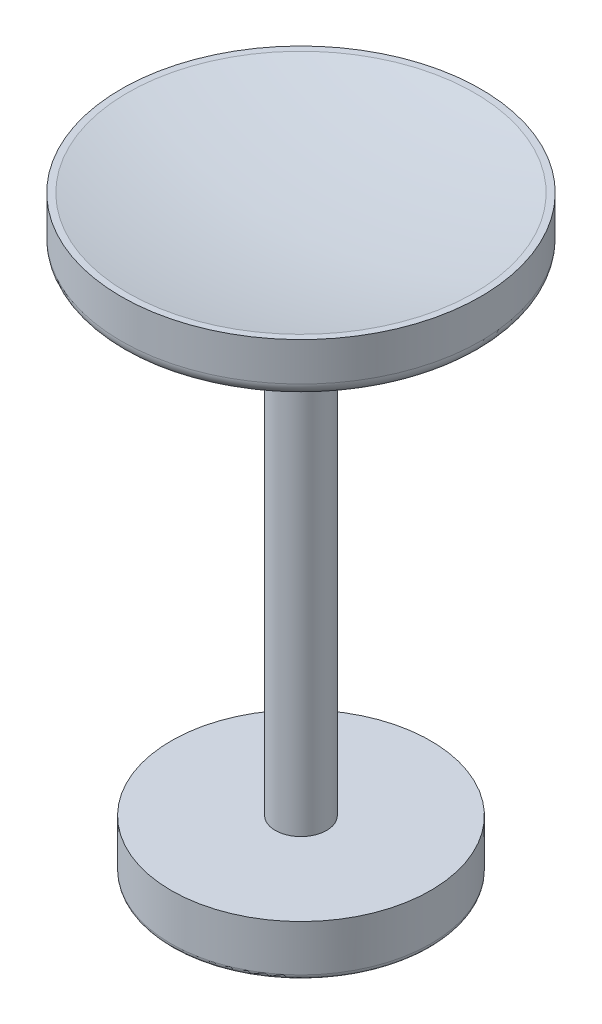
ISO-10303-21;
HEADER;
FILE_DESCRIPTION(('STEP AP214'),'2;1');
FILE_NAME('part.step','',(''),(''),'','','');
FILE_SCHEMA(('AUTOMOTIVE_DESIGN { 1 0 10303 214 1 1 1 1 }'));
ENDSEC;
DATA;
#1=APPLICATION_CONTEXT('core data for automotive mechanical design processes');
#2=APPLICATION_PROTOCOL_DEFINITION('international standard','automotive_design',2000,#1);
#3=PRODUCT_CONTEXT('',#1,'mechanical');
#4=PRODUCT('Part','Part','',(#3));
#5=PRODUCT_RELATED_PRODUCT_CATEGORY('part','',(#4));
#6=PRODUCT_DEFINITION_FORMATION('','',#4);
#7=PRODUCT_DEFINITION_CONTEXT('part definition',#1,'design');
#8=PRODUCT_DEFINITION('design','',#6,#7);
#9=PRODUCT_DEFINITION_SHAPE('','',#8);
#10=(LENGTH_UNIT() NAMED_UNIT(*) SI_UNIT(.MILLI.,.METRE.));
#11=(NAMED_UNIT(*) PLANE_ANGLE_UNIT() SI_UNIT($,.RADIAN.));
#12=(NAMED_UNIT(*) SI_UNIT($,.STERADIAN.) SOLID_ANGLE_UNIT());
#13=UNCERTAINTY_MEASURE_WITH_UNIT(LENGTH_MEASURE(1.E-05),#10,'distance_accuracy_value','');
#14=(GEOMETRIC_REPRESENTATION_CONTEXT(3) GLOBAL_UNCERTAINTY_ASSIGNED_CONTEXT((#13)) GLOBAL_UNIT_ASSIGNED_CONTEXT((#10,
#11,#12)) REPRESENTATION_CONTEXT('',''));
#15=CARTESIAN_POINT('',(0.,0.,0.));
#16=DIRECTION('',(0.,0.,1.));
#17=DIRECTION('',(1.,0.,0.));
#18=AXIS2_PLACEMENT_3D('',#15,#16,#17);
#19=CARTESIAN_POINT('',(0.,2.54,0.));
#20=DIRECTION('',(0.,-1.,0.));
#21=DIRECTION('',(0.,0.,-1.));
#22=AXIS2_PLACEMENT_3D('',#19,#20,#21);
#23=CYLINDRICAL_SURFACE('',#22,17.78);
#24=CARTESIAN_POINT('',(0.,1.27,0.));
#25=DIRECTION('',(0.,1.,0.));
#26=DIRECTION('',(0.,0.,1.));
#27=AXIS2_PLACEMENT_3D('',#24,#25,#26);
#28=CIRCLE('',#27,17.78);
#29=CARTESIAN_POINT('',(0.,1.27,17.78));
#30=VERTEX_POINT('',#29);
#31=EDGE_CURVE('E39',#30,#30,#28,.T.);
#32=ORIENTED_EDGE('',*,*,#31,.T.);
#33=EDGE_LOOP('',(#32));
#34=FACE_BOUND('',#33,.T.);
#35=CARTESIAN_POINT('',(0.,5.08,0.));
#36=DIRECTION('',(0.,1.,0.));
#37=DIRECTION('',(0.,0.,1.));
#38=AXIS2_PLACEMENT_3D('',#35,#36,#37);
#39=CIRCLE('',#38,17.78);
#40=CARTESIAN_POINT('',(0.,5.08,17.78));
#41=VERTEX_POINT('',#40);
#42=EDGE_CURVE('E55',#41,#41,#39,.T.);
#43=ORIENTED_EDGE('',*,*,#42,.F.);
#44=EDGE_LOOP('',(#43));
#45=FACE_BOUND('',#44,.T.);
#46=ADVANCED_FACE('F32',(#34,#45),#23,.T.);
#47=CARTESIAN_POINT('',(0.,0.,0.));
#48=DIRECTION('',(0.,1.,0.));
#49=DIRECTION('',(0.,0.,1.));
#50=AXIS2_PLACEMENT_3D('',#47,#48,#49);
#51=PLANE('',#50);
#52=CARTESIAN_POINT('',(0.,0.,0.));
#53=DIRECTION('',(0.,1.,0.));
#54=DIRECTION('',(0.,0.,1.));
#55=AXIS2_PLACEMENT_3D('',#52,#53,#54);
#56=CIRCLE('',#55,16.51);
#57=CARTESIAN_POINT('',(0.,0.,16.51));
#58=VERTEX_POINT('',#57);
#59=EDGE_CURVE('E10',#58,#58,#56,.F.);
#60=ORIENTED_EDGE('',*,*,#59,.T.);
#61=EDGE_LOOP('',(#60));
#62=FACE_BOUND('',#61,.T.);
#63=CARTESIAN_POINT('',(0.,0.,0.));
#64=DIRECTION('',(0.,1.,0.));
#65=DIRECTION('',(0.,0.,1.));
#66=AXIS2_PLACEMENT_3D('',#63,#64,#65);
#67=CIRCLE('',#66,2.54);
#68=CARTESIAN_POINT('',(0.,0.,2.54));
#69=VERTEX_POINT('',#68);
#70=EDGE_CURVE('E64',#69,#69,#67,.T.);
#71=ORIENTED_EDGE('',*,*,#70,.T.);
#72=EDGE_LOOP('',(#71));
#73=FACE_BOUND('',#72,.T.);
#74=ADVANCED_FACE('F68',(#62,#73),#51,.F.);
#75=CARTESIAN_POINT('',(0.,81.2800000000001,0.));
#76=DIRECTION('',(0.,1.,0.));
#77=DIRECTION('',(0.,0.,1.));
#78=AXIS2_PLACEMENT_3D('',#75,#76,#77);
#79=SPHERICAL_SURFACE('',#78,78.1050000000001);
#80=CARTESIAN_POINT('',(0.,5.08,0.));
#81=DIRECTION('',(0.,1.,0.));
#82=DIRECTION('',(0.,0.,1.));
#83=AXIS2_PLACEMENT_3D('',#80,#81,#82);
#84=CIRCLE('',#83,17.145);
#85=CARTESIAN_POINT('',(0.,5.08,17.145));
#86=VERTEX_POINT('',#85);
#87=EDGE_CURVE('E52',#86,#86,#84,.T.);
#88=ORIENTED_EDGE('',*,*,#87,.T.);
#89=EDGE_LOOP('',(#88));
#90=FACE_BOUND('',#89,.T.);
#91=ADVANCED_FACE('F89',(#90),#79,.F.);
#92=CARTESIAN_POINT('',(0.,5.08,17.78));
#93=DIRECTION('',(0.,1.,0.));
#94=DIRECTION('',(0.,0.,1.));
#95=AXIS2_PLACEMENT_3D('',#92,#93,#94);
#96=PLANE('',#95);
#97=ORIENTED_EDGE('',*,*,#42,.T.);
#98=EDGE_LOOP('',(#97));
#99=FACE_BOUND('',#98,.T.);
#100=ORIENTED_EDGE('',*,*,#87,.F.);
#101=EDGE_LOOP('',(#100));
#102=FACE_BOUND('',#101,.T.);
#103=ADVANCED_FACE('F95',(#99,#102),#96,.T.);
#104=CARTESIAN_POINT('',(0.,-53.34,0.));
#105=DIRECTION('',(0.,-1.,0.));
#106=DIRECTION('',(0.,0.,-1.));
#107=AXIS2_PLACEMENT_3D('',#104,#105,#106);
#108=PLANE('',#107);
#109=CARTESIAN_POINT('',(0.,-53.34,0.));
#110=DIRECTION('',(0.,-1.,0.));
#111=DIRECTION('',(0.,0.,-1.));
#112=AXIS2_PLACEMENT_3D('',#109,#110,#111);
#113=CIRCLE('',#112,12.319);
#114=CARTESIAN_POINT('',(0.,-53.34,-12.319));
#115=VERTEX_POINT('',#114);
#116=EDGE_CURVE('E43',#115,#115,#113,.T.);
#117=ORIENTED_EDGE('',*,*,#116,.T.);
#118=EDGE_LOOP('',(#117));
#119=FACE_BOUND('',#118,.T.);
#120=ADVANCED_FACE('F99',(#119),#108,.T.);
#121=CARTESIAN_POINT('',(0.,0.,0.));
#122=DIRECTION('',(0.,1.,0.));
#123=DIRECTION('',(0.,0.,1.));
#124=AXIS2_PLACEMENT_3D('',#121,#122,#123);
#125=CYLINDRICAL_SURFACE('',#124,12.827);
#126=CARTESIAN_POINT('',(0.,-52.832,0.));
#127=DIRECTION('',(0.,-1.,0.));
#128=DIRECTION('',(0.,0.,-1.));
#129=AXIS2_PLACEMENT_3D('',#126,#127,#128);
#130=CIRCLE('',#129,12.827);
#131=CARTESIAN_POINT('',(0.,-52.832,-12.827));
#132=VERTEX_POINT('',#131);
#133=EDGE_CURVE('E47',#132,#132,#130,.F.);
#134=ORIENTED_EDGE('',*,*,#133,.T.);
#135=EDGE_LOOP('',(#134));
#136=FACE_BOUND('',#135,.T.);
#137=CARTESIAN_POINT('',(0.,-48.26,0.));
#138=DIRECTION('',(0.,1.,0.));
#139=DIRECTION('',(0.,0.,1.));
#140=AXIS2_PLACEMENT_3D('',#137,#138,#139);
#141=CIRCLE('',#140,12.827);
#142=CARTESIAN_POINT('',(0.,-48.26,12.827));
#143=VERTEX_POINT('',#142);
#144=EDGE_CURVE('E58',#143,#143,#141,.T.);
#145=ORIENTED_EDGE('',*,*,#144,.F.);
#146=EDGE_LOOP('',(#145));
#147=FACE_BOUND('',#146,.T.);
#148=ADVANCED_FACE('F81',(#136,#147),#125,.T.);
#149=CARTESIAN_POINT('',(0.,-48.26,12.827));
#150=DIRECTION('',(0.,1.,0.));
#151=DIRECTION('',(0.,0.,1.));
#152=AXIS2_PLACEMENT_3D('',#149,#150,#151);
#153=PLANE('',#152);
#154=ORIENTED_EDGE('',*,*,#144,.T.);
#155=EDGE_LOOP('',(#154));
#156=FACE_BOUND('',#155,.T.);
#157=CARTESIAN_POINT('',(0.,-48.26,0.));
#158=DIRECTION('',(0.,1.,0.));
#159=DIRECTION('',(0.,0.,1.));
#160=AXIS2_PLACEMENT_3D('',#157,#158,#159);
#161=CIRCLE('',#160,2.54000000000001);
#162=CARTESIAN_POINT('',(0.,-48.26,2.54));
#163=VERTEX_POINT('',#162);
#164=EDGE_CURVE('E61',#163,#163,#161,.T.);
#165=ORIENTED_EDGE('',*,*,#164,.F.);
#166=EDGE_LOOP('',(#165));
#167=FACE_BOUND('',#166,.T.);
#168=ADVANCED_FACE('F73',(#156,#167),#153,.T.);
#169=CARTESIAN_POINT('',(0.,0.,0.));
#170=DIRECTION('',(0.,1.,0.));
#171=DIRECTION('',(0.,0.,1.));
#172=AXIS2_PLACEMENT_3D('',#169,#170,#171);
#173=CYLINDRICAL_SURFACE('',#172,2.54);
#174=ORIENTED_EDGE('',*,*,#164,.T.);
#175=EDGE_LOOP('',(#174));
#176=FACE_BOUND('',#175,.T.);
#177=ORIENTED_EDGE('',*,*,#70,.F.);
#178=EDGE_LOOP('',(#177));
#179=FACE_BOUND('',#178,.T.);
#180=ADVANCED_FACE('F70',(#176,#179),#173,.T.);
#181=CARTESIAN_POINT('',(0.,-52.832,0.));
#182=DIRECTION('',(0.,-1.,0.));
#183=DIRECTION('',(0.,0.,-1.));
#184=AXIS2_PLACEMENT_3D('',#181,#182,#183);
#185=TOROIDAL_SURFACE('',#184,12.319,0.508);
#186=ORIENTED_EDGE('',*,*,#116,.F.);
#187=EDGE_LOOP('',(#186));
#188=FACE_BOUND('',#187,.T.);
#189=ORIENTED_EDGE('',*,*,#133,.F.);
#190=EDGE_LOOP('',(#189));
#191=FACE_BOUND('',#190,.T.);
#192=ADVANCED_FACE('F72',(#188,#191),#185,.T.);
#193=CARTESIAN_POINT('',(0.,1.27,0.));
#194=DIRECTION('',(0.,1.,0.));
#195=DIRECTION('',(0.,0.,1.));
#196=AXIS2_PLACEMENT_3D('',#193,#194,#195);
#197=TOROIDAL_SURFACE('',#196,16.51,1.27);
#198=ORIENTED_EDGE('',*,*,#59,.F.);
#199=EDGE_LOOP('',(#198));
#200=FACE_BOUND('',#199,.T.);
#201=ORIENTED_EDGE('',*,*,#31,.F.);
#202=EDGE_LOOP('',(#201));
#203=FACE_BOUND('',#202,.T.);
#204=ADVANCED_FACE('F34',(#200,#203),#197,.T.);
#205=CLOSED_SHELL('',(#46,#74,#91,#103,#120,#148,#168,#180,#192,#204));
#206=MANIFOLD_SOLID_BREP('B2',#205);
#207=ADVANCED_BREP_SHAPE_REPRESENTATION('',(#18,#206),#14);
#208=SHAPE_DEFINITION_REPRESENTATION(#9,#207);
ENDSEC;
END-ISO-10303-21;
